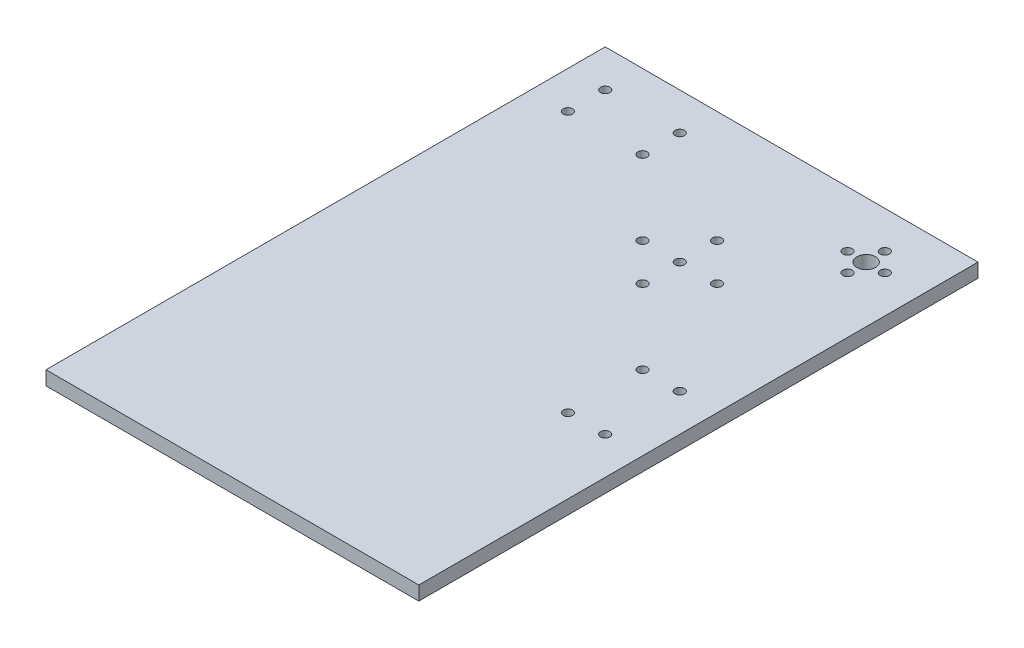
ISO-10303-21;
HEADER;
FILE_DESCRIPTION(('STEP AP214'),'2;1');
FILE_NAME('part.step','',(''),(''),'','','');
FILE_SCHEMA(('AUTOMOTIVE_DESIGN { 1 0 10303 214 1 1 1 1 }'));
ENDSEC;
DATA;
#1=APPLICATION_CONTEXT('core data for automotive mechanical design processes');
#2=APPLICATION_PROTOCOL_DEFINITION('international standard','automotive_design',2000,#1);
#3=PRODUCT_CONTEXT('',#1,'mechanical');
#4=PRODUCT('Part','Part','',(#3));
#5=PRODUCT_RELATED_PRODUCT_CATEGORY('part','',(#4));
#6=PRODUCT_DEFINITION_FORMATION('','',#4);
#7=PRODUCT_DEFINITION_CONTEXT('part definition',#1,'design');
#8=PRODUCT_DEFINITION('design','',#6,#7);
#9=PRODUCT_DEFINITION_SHAPE('','',#8);
#10=(LENGTH_UNIT() NAMED_UNIT(*) SI_UNIT(.MILLI.,.METRE.));
#11=(NAMED_UNIT(*) PLANE_ANGLE_UNIT() SI_UNIT($,.RADIAN.));
#12=(NAMED_UNIT(*) SI_UNIT($,.STERADIAN.) SOLID_ANGLE_UNIT());
#13=UNCERTAINTY_MEASURE_WITH_UNIT(LENGTH_MEASURE(1.E-05),#10,'distance_accuracy_value','');
#14=(GEOMETRIC_REPRESENTATION_CONTEXT(3) GLOBAL_UNCERTAINTY_ASSIGNED_CONTEXT((#13)) GLOBAL_UNIT_ASSIGNED_CONTEXT((#10,
#11,#12)) REPRESENTATION_CONTEXT('',''));
#15=CARTESIAN_POINT('',(0.,0.,0.));
#16=DIRECTION('',(0.,0.,1.));
#17=DIRECTION('',(1.,0.,0.));
#18=AXIS2_PLACEMENT_3D('',#15,#16,#17);
#19=CARTESIAN_POINT('',(-127.,9.525,127.));
#20=DIRECTION('',(1.,0.,0.));
#21=DIRECTION('',(0.,0.,-1.));
#22=AXIS2_PLACEMENT_3D('',#19,#20,#21);
#23=PLANE('',#22);
#24=DIRECTION('',(0.,0.,1.));
#25=VECTOR('',#24,1.);
#26=CARTESIAN_POINT('',(-127.,0.,127.));
#27=LINE('',#26,#25);
#28=CARTESIAN_POINT('',(-127.,0.,-127.));
#29=VERTEX_POINT('',#28);
#30=CARTESIAN_POINT('',(-127.,0.,254.));
#31=VERTEX_POINT('',#30);
#32=EDGE_CURVE('E82',#29,#31,#27,.T.);
#33=ORIENTED_EDGE('',*,*,#32,.T.);
#34=DIRECTION('',(0.,-1.,0.));
#35=VECTOR('',#34,1.);
#36=CARTESIAN_POINT('',(-127.,9.525,254.));
#37=LINE('',#36,#35);
#38=CARTESIAN_POINT('',(-127.,9.525,254.));
#39=VERTEX_POINT('',#38);
#40=EDGE_CURVE('E85',#39,#31,#37,.T.);
#41=ORIENTED_EDGE('',*,*,#40,.F.);
#42=DIRECTION('',(0.,0.,1.));
#43=VECTOR('',#42,1.);
#44=CARTESIAN_POINT('',(-127.,9.525,127.));
#45=LINE('',#44,#43);
#46=CARTESIAN_POINT('',(-127.,9.525,-127.));
#47=VERTEX_POINT('',#46);
#48=EDGE_CURVE('E69',#47,#39,#45,.T.);
#49=ORIENTED_EDGE('',*,*,#48,.F.);
#50=DIRECTION('',(0.,-1.,0.));
#51=VECTOR('',#50,1.);
#52=CARTESIAN_POINT('',(-127.,9.525,-127.));
#53=LINE('',#52,#51);
#54=EDGE_CURVE('E45',#47,#29,#53,.T.);
#55=ORIENTED_EDGE('',*,*,#54,.T.);
#56=EDGE_LOOP('',(#33,#41,#49,#55));
#57=FACE_BOUND('',#56,.T.);
#58=ADVANCED_FACE('F37',(#57),#23,.F.);
#59=CARTESIAN_POINT('',(127.,9.525,127.));
#60=DIRECTION('',(-1.,0.,0.));
#61=DIRECTION('',(0.,0.,1.));
#62=AXIS2_PLACEMENT_3D('',#59,#60,#61);
#63=PLANE('',#62);
#64=DIRECTION('',(0.,0.,-1.));
#65=VECTOR('',#64,1.);
#66=CARTESIAN_POINT('',(127.,0.,127.));
#67=LINE('',#66,#65);
#68=CARTESIAN_POINT('',(127.,0.,254.));
#69=VERTEX_POINT('',#68);
#70=CARTESIAN_POINT('',(127.,0.,-127.));
#71=VERTEX_POINT('',#70);
#72=EDGE_CURVE('E64',#69,#71,#67,.T.);
#73=ORIENTED_EDGE('',*,*,#72,.T.);
#74=DIRECTION('',(0.,-1.,0.));
#75=VECTOR('',#74,1.);
#76=CARTESIAN_POINT('',(127.,9.525,-127.));
#77=LINE('',#76,#75);
#78=CARTESIAN_POINT('',(127.,9.525,-127.));
#79=VERTEX_POINT('',#78);
#80=EDGE_CURVE('E11',#79,#71,#77,.T.);
#81=ORIENTED_EDGE('',*,*,#80,.F.);
#82=DIRECTION('',(0.,0.,-1.));
#83=VECTOR('',#82,1.);
#84=CARTESIAN_POINT('',(127.,9.525,127.));
#85=LINE('',#84,#83);
#86=CARTESIAN_POINT('',(127.,9.525,254.));
#87=VERTEX_POINT('',#86);
#88=EDGE_CURVE('E226',#87,#79,#85,.T.);
#89=ORIENTED_EDGE('',*,*,#88,.F.);
#90=DIRECTION('',(0.,1.,0.));
#91=VECTOR('',#90,1.);
#92=CARTESIAN_POINT('',(127.,0.,254.));
#93=LINE('',#92,#91);
#94=EDGE_CURVE('E97',#69,#87,#93,.T.);
#95=ORIENTED_EDGE('',*,*,#94,.F.);
#96=EDGE_LOOP('',(#73,#81,#89,#95));
#97=FACE_BOUND('',#96,.T.);
#98=ADVANCED_FACE('F234',(#97),#63,.F.);
#99=CARTESIAN_POINT('',(127.,9.525,-127.));
#100=DIRECTION('',(0.,0.,1.));
#101=DIRECTION('',(1.,0.,0.));
#102=AXIS2_PLACEMENT_3D('',#99,#100,#101);
#103=PLANE('',#102);
#104=DIRECTION('',(-1.,0.,0.));
#105=VECTOR('',#104,1.);
#106=CARTESIAN_POINT('',(127.,0.,-127.));
#107=LINE('',#106,#105);
#108=EDGE_CURVE('E227',#71,#29,#107,.T.);
#109=ORIENTED_EDGE('',*,*,#108,.T.);
#110=ORIENTED_EDGE('',*,*,#54,.F.);
#111=DIRECTION('',(-1.,0.,0.));
#112=VECTOR('',#111,1.);
#113=CARTESIAN_POINT('',(127.,9.525,-127.));
#114=LINE('',#113,#112);
#115=EDGE_CURVE('E53',#79,#47,#114,.T.);
#116=ORIENTED_EDGE('',*,*,#115,.F.);
#117=ORIENTED_EDGE('',*,*,#80,.T.);
#118=EDGE_LOOP('',(#109,#110,#116,#117));
#119=FACE_BOUND('',#118,.T.);
#120=ADVANCED_FACE('F233',(#119),#103,.F.);
#121=CARTESIAN_POINT('',(0.,9.525,0.));
#122=DIRECTION('',(0.,1.,0.));
#123=DIRECTION('',(0.,0.,1.));
#124=AXIS2_PLACEMENT_3D('',#121,#122,#123);
#125=PLANE('',#124);
#126=CARTESIAN_POINT('',(88.9,9.525,-88.9000000000001));
#127=DIRECTION('',(0.,1.,0.));
#128=DIRECTION('',(0.,0.,1.));
#129=AXIS2_PLACEMENT_3D('',#126,#127,#128);
#130=CIRCLE('',#129,6.34999999999999);
#131=CARTESIAN_POINT('',(88.9,9.525,-82.5500000000001));
#132=VERTEX_POINT('',#131);
#133=EDGE_CURVE('E106',#132,#132,#130,.T.);
#134=ORIENTED_EDGE('',*,*,#133,.F.);
#135=EDGE_LOOP('',(#134));
#136=FACE_BOUND('',#135,.T.);
#137=CARTESIAN_POINT('',(-50.8,9.525,-76.2000000000001));
#138=DIRECTION('',(0.,1.,0.));
#139=DIRECTION('',(0.,0.,1.));
#140=AXIS2_PLACEMENT_3D('',#137,#138,#139);
#141=CIRCLE('',#140,3.17499999999998);
#142=CARTESIAN_POINT('',(-50.8,9.525,-73.0250000000001));
#143=VERTEX_POINT('',#142);
#144=EDGE_CURVE('E112',#143,#143,#141,.T.);
#145=ORIENTED_EDGE('',*,*,#144,.F.);
#146=EDGE_LOOP('',(#145));
#147=FACE_BOUND('',#146,.T.);
#148=CARTESIAN_POINT('',(-50.8,9.525,-101.6));
#149=DIRECTION('',(0.,1.,0.));
#150=DIRECTION('',(0.,0.,1.));
#151=AXIS2_PLACEMENT_3D('',#148,#149,#150);
#152=CIRCLE('',#151,3.17499999999998);
#153=CARTESIAN_POINT('',(-50.8,9.525,-98.4250000000001));
#154=VERTEX_POINT('',#153);
#155=EDGE_CURVE('E120',#154,#154,#152,.T.);
#156=ORIENTED_EDGE('',*,*,#155,.F.);
#157=EDGE_LOOP('',(#156));
#158=FACE_BOUND('',#157,.T.);
#159=CARTESIAN_POINT('',(76.2,9.525,50.7999999999999));
#160=DIRECTION('',(0.,1.,0.));
#161=DIRECTION('',(0.,0.,1.));
#162=AXIS2_PLACEMENT_3D('',#159,#160,#161);
#163=CIRCLE('',#162,3.17499999999998);
#164=CARTESIAN_POINT('',(76.2,9.525,53.9749999999999));
#165=VERTEX_POINT('',#164);
#166=EDGE_CURVE('E128',#165,#165,#163,.T.);
#167=ORIENTED_EDGE('',*,*,#166,.F.);
#168=EDGE_LOOP('',(#167));
#169=FACE_BOUND('',#168,.T.);
#170=CARTESIAN_POINT('',(101.6,9.525,50.7999999999999));
#171=DIRECTION('',(0.,1.,0.));
#172=DIRECTION('',(0.,0.,1.));
#173=AXIS2_PLACEMENT_3D('',#170,#171,#172);
#174=CIRCLE('',#173,3.17499999999998);
#175=CARTESIAN_POINT('',(101.6,9.525,53.9749999999999));
#176=VERTEX_POINT('',#175);
#177=EDGE_CURVE('E134',#176,#176,#174,.T.);
#178=ORIENTED_EDGE('',*,*,#177,.F.);
#179=EDGE_LOOP('',(#178));
#180=FACE_BOUND('',#179,.T.);
#181=CARTESIAN_POINT('',(76.2,9.525,101.6));
#182=DIRECTION('',(0.,1.,0.));
#183=DIRECTION('',(0.,0.,1.));
#184=AXIS2_PLACEMENT_3D('',#181,#182,#183);
#185=CIRCLE('',#184,3.17499999999998);
#186=CARTESIAN_POINT('',(76.2,9.525,104.775));
#187=VERTEX_POINT('',#186);
#188=EDGE_CURVE('E140',#187,#187,#185,.T.);
#189=ORIENTED_EDGE('',*,*,#188,.F.);
#190=EDGE_LOOP('',(#189));
#191=FACE_BOUND('',#190,.T.);
#192=CARTESIAN_POINT('',(101.6,9.525,101.6));
#193=DIRECTION('',(0.,1.,0.));
#194=DIRECTION('',(0.,0.,1.));
#195=AXIS2_PLACEMENT_3D('',#192,#193,#194);
#196=CIRCLE('',#195,3.17499999999998);
#197=CARTESIAN_POINT('',(101.6,9.525,104.775));
#198=VERTEX_POINT('',#197);
#199=EDGE_CURVE('E146',#198,#198,#196,.T.);
#200=ORIENTED_EDGE('',*,*,#199,.F.);
#201=EDGE_LOOP('',(#200));
#202=FACE_BOUND('',#201,.T.);
#203=CARTESIAN_POINT('',(-101.6,9.525,-76.2000000000001));
#204=DIRECTION('',(0.,1.,0.));
#205=DIRECTION('',(0.,0.,1.));
#206=AXIS2_PLACEMENT_3D('',#203,#204,#205);
#207=CIRCLE('',#206,3.17499999999998);
#208=CARTESIAN_POINT('',(-101.6,9.525,-73.0250000000001));
#209=VERTEX_POINT('',#208);
#210=EDGE_CURVE('E152',#209,#209,#207,.T.);
#211=ORIENTED_EDGE('',*,*,#210,.F.);
#212=EDGE_LOOP('',(#211));
#213=FACE_BOUND('',#212,.T.);
#214=CARTESIAN_POINT('',(-101.6,9.525,-101.6));
#215=DIRECTION('',(0.,1.,0.));
#216=DIRECTION('',(0.,0.,1.));
#217=AXIS2_PLACEMENT_3D('',#214,#215,#216);
#218=CIRCLE('',#217,3.17499999999998);
#219=CARTESIAN_POINT('',(-101.6,9.525,-98.4250000000001));
#220=VERTEX_POINT('',#219);
#221=EDGE_CURVE('E160',#220,#220,#218,.T.);
#222=ORIENTED_EDGE('',*,*,#221,.F.);
#223=EDGE_LOOP('',(#222));
#224=FACE_BOUND('',#223,.T.);
#225=CARTESIAN_POINT('',(25.4,9.525,-50.8000000000001));
#226=DIRECTION('',(0.,1.,0.));
#227=DIRECTION('',(0.,0.,1.));
#228=AXIS2_PLACEMENT_3D('',#225,#226,#227);
#229=CIRCLE('',#228,3.17499999999998);
#230=CARTESIAN_POINT('',(25.4,9.525,-47.6250000000001));
#231=VERTEX_POINT('',#230);
#232=EDGE_CURVE('E166',#231,#231,#229,.T.);
#233=ORIENTED_EDGE('',*,*,#232,.F.);
#234=EDGE_LOOP('',(#233));
#235=FACE_BOUND('',#234,.T.);
#236=CARTESIAN_POINT('',(50.8,9.525,-25.4000000000001));
#237=DIRECTION('',(0.,1.,0.));
#238=DIRECTION('',(0.,0.,1.));
#239=AXIS2_PLACEMENT_3D('',#236,#237,#238);
#240=CIRCLE('',#239,3.17499999999998);
#241=CARTESIAN_POINT('',(50.8,9.525,-22.2250000000001));
#242=VERTEX_POINT('',#241);
#243=EDGE_CURVE('E172',#242,#242,#240,.T.);
#244=ORIENTED_EDGE('',*,*,#243,.F.);
#245=EDGE_LOOP('',(#244));
#246=FACE_BOUND('',#245,.T.);
#247=CARTESIAN_POINT('',(25.4,9.525,0.));
#248=DIRECTION('',(0.,1.,0.));
#249=DIRECTION('',(0.,0.,1.));
#250=AXIS2_PLACEMENT_3D('',#247,#248,#249);
#251=CIRCLE('',#250,3.17499999999998);
#252=CARTESIAN_POINT('',(25.4,9.525,3.17499999999991));
#253=VERTEX_POINT('',#252);
#254=EDGE_CURVE('E178',#253,#253,#251,.T.);
#255=ORIENTED_EDGE('',*,*,#254,.F.);
#256=EDGE_LOOP('',(#255));
#257=FACE_BOUND('',#256,.T.);
#258=CARTESIAN_POINT('',(0.,9.525,-25.4000000000001));
#259=DIRECTION('',(0.,1.,0.));
#260=DIRECTION('',(0.,0.,1.));
#261=AXIS2_PLACEMENT_3D('',#258,#259,#260);
#262=CIRCLE('',#261,3.17499999999998);
#263=CARTESIAN_POINT('',(0.,9.525,-22.2250000000001));
#264=VERTEX_POINT('',#263);
#265=EDGE_CURVE('E185',#264,#264,#262,.T.);
#266=ORIENTED_EDGE('',*,*,#265,.F.);
#267=EDGE_LOOP('',(#266));
#268=FACE_BOUND('',#267,.T.);
#269=CARTESIAN_POINT('',(25.4,9.525,-25.4000000000001));
#270=DIRECTION('',(0.,1.,0.));
#271=DIRECTION('',(0.,0.,1.));
#272=AXIS2_PLACEMENT_3D('',#269,#270,#271);
#273=CIRCLE('',#272,3.17499999999998);
#274=CARTESIAN_POINT('',(25.4,9.525,-22.2250000000001));
#275=VERTEX_POINT('',#274);
#276=EDGE_CURVE('E193',#275,#275,#273,.T.);
#277=ORIENTED_EDGE('',*,*,#276,.F.);
#278=EDGE_LOOP('',(#277));
#279=FACE_BOUND('',#278,.T.);
#280=CARTESIAN_POINT('',(88.9,9.525,-76.2000000000001));
#281=DIRECTION('',(0.,1.,0.));
#282=DIRECTION('',(0.,0.,1.));
#283=AXIS2_PLACEMENT_3D('',#280,#281,#282);
#284=CIRCLE('',#283,3.17499999999998);
#285=CARTESIAN_POINT('',(88.9,9.525,-73.0250000000001));
#286=VERTEX_POINT('',#285);
#287=EDGE_CURVE('E201',#286,#286,#284,.T.);
#288=ORIENTED_EDGE('',*,*,#287,.F.);
#289=EDGE_LOOP('',(#288));
#290=FACE_BOUND('',#289,.T.);
#291=CARTESIAN_POINT('',(76.2,9.525,-88.9000000000001));
#292=DIRECTION('',(0.,1.,0.));
#293=DIRECTION('',(0.,0.,1.));
#294=AXIS2_PLACEMENT_3D('',#291,#292,#293);
#295=CIRCLE('',#294,3.17499999999998);
#296=CARTESIAN_POINT('',(76.2,9.525,-85.7250000000001));
#297=VERTEX_POINT('',#296);
#298=EDGE_CURVE('E207',#297,#297,#295,.T.);
#299=ORIENTED_EDGE('',*,*,#298,.F.);
#300=EDGE_LOOP('',(#299));
#301=FACE_BOUND('',#300,.T.);
#302=CARTESIAN_POINT('',(88.9,9.525,-101.6));
#303=DIRECTION('',(0.,1.,0.));
#304=DIRECTION('',(0.,0.,1.));
#305=AXIS2_PLACEMENT_3D('',#302,#303,#304);
#306=CIRCLE('',#305,3.17499999999998);
#307=CARTESIAN_POINT('',(88.9,9.525,-98.4250000000001));
#308=VERTEX_POINT('',#307);
#309=EDGE_CURVE('E213',#308,#308,#306,.T.);
#310=ORIENTED_EDGE('',*,*,#309,.F.);
#311=EDGE_LOOP('',(#310));
#312=FACE_BOUND('',#311,.T.);
#313=CARTESIAN_POINT('',(101.6,9.525,-88.9000000000001));
#314=DIRECTION('',(0.,1.,0.));
#315=DIRECTION('',(0.,0.,1.));
#316=AXIS2_PLACEMENT_3D('',#313,#314,#315);
#317=CIRCLE('',#316,3.17499999999998);
#318=CARTESIAN_POINT('',(101.6,9.525,-85.7250000000001));
#319=VERTEX_POINT('',#318);
#320=EDGE_CURVE('E219',#319,#319,#317,.T.);
#321=ORIENTED_EDGE('',*,*,#320,.F.);
#322=EDGE_LOOP('',(#321));
#323=FACE_BOUND('',#322,.T.);
#324=ORIENTED_EDGE('',*,*,#48,.T.);
#325=DIRECTION('',(-1.,0.,0.));
#326=VECTOR('',#325,1.);
#327=CARTESIAN_POINT('',(127.,9.525,254.));
#328=LINE('',#327,#326);
#329=EDGE_CURVE('E100',#87,#39,#328,.T.);
#330=ORIENTED_EDGE('',*,*,#329,.F.);
#331=ORIENTED_EDGE('',*,*,#88,.T.);
#332=ORIENTED_EDGE('',*,*,#115,.T.);
#333=EDGE_LOOP('',(#324,#330,#331,#332));
#334=FACE_BOUND('',#333,.T.);
#335=ADVANCED_FACE('F235',(#136,#147,#158,#169,#180,#191,#202,#213,#224,#235,#246,#257,#268,
#279,#290,#301,#312,#323,#334),#125,.T.);
#336=CARTESIAN_POINT('',(0.,0.,0.));
#337=DIRECTION('',(0.,1.,0.));
#338=DIRECTION('',(0.,0.,1.));
#339=AXIS2_PLACEMENT_3D('',#336,#337,#338);
#340=PLANE('',#339);
#341=CARTESIAN_POINT('',(88.9,0.,-88.9000000000001));
#342=DIRECTION('',(0.,1.,0.));
#343=DIRECTION('',(0.,0.,1.));
#344=AXIS2_PLACEMENT_3D('',#341,#342,#343);
#345=CIRCLE('',#344,6.34999999999999);
#346=CARTESIAN_POINT('',(88.9,0.,-82.5500000000001));
#347=VERTEX_POINT('',#346);
#348=EDGE_CURVE('E109',#347,#347,#345,.T.);
#349=ORIENTED_EDGE('',*,*,#348,.T.);
#350=EDGE_LOOP('',(#349));
#351=FACE_BOUND('',#350,.T.);
#352=CARTESIAN_POINT('',(-50.8,0.,-76.2000000000001));
#353=DIRECTION('',(0.,1.,0.));
#354=DIRECTION('',(0.,0.,1.));
#355=AXIS2_PLACEMENT_3D('',#352,#353,#354);
#356=CIRCLE('',#355,3.17499999999998);
#357=CARTESIAN_POINT('',(-50.8,0.,-73.0250000000001));
#358=VERTEX_POINT('',#357);
#359=EDGE_CURVE('E116',#358,#358,#356,.T.);
#360=ORIENTED_EDGE('',*,*,#359,.T.);
#361=EDGE_LOOP('',(#360));
#362=FACE_BOUND('',#361,.T.);
#363=CARTESIAN_POINT('',(-50.8,0.,-101.6));
#364=DIRECTION('',(0.,1.,0.));
#365=DIRECTION('',(0.,0.,1.));
#366=AXIS2_PLACEMENT_3D('',#363,#364,#365);
#367=CIRCLE('',#366,3.17499999999998);
#368=CARTESIAN_POINT('',(-50.8,0.,-98.4250000000001));
#369=VERTEX_POINT('',#368);
#370=EDGE_CURVE('E124',#369,#369,#367,.T.);
#371=ORIENTED_EDGE('',*,*,#370,.T.);
#372=EDGE_LOOP('',(#371));
#373=FACE_BOUND('',#372,.T.);
#374=CARTESIAN_POINT('',(76.2,0.,50.7999999999999));
#375=DIRECTION('',(0.,1.,0.));
#376=DIRECTION('',(0.,0.,1.));
#377=AXIS2_PLACEMENT_3D('',#374,#375,#376);
#378=CIRCLE('',#377,3.17499999999998);
#379=CARTESIAN_POINT('',(76.2,0.,53.9749999999999));
#380=VERTEX_POINT('',#379);
#381=EDGE_CURVE('E131',#380,#380,#378,.T.);
#382=ORIENTED_EDGE('',*,*,#381,.T.);
#383=EDGE_LOOP('',(#382));
#384=FACE_BOUND('',#383,.T.);
#385=CARTESIAN_POINT('',(101.6,0.,50.7999999999999));
#386=DIRECTION('',(0.,1.,0.));
#387=DIRECTION('',(0.,0.,1.));
#388=AXIS2_PLACEMENT_3D('',#385,#386,#387);
#389=CIRCLE('',#388,3.17499999999998);
#390=CARTESIAN_POINT('',(101.6,0.,53.9749999999999));
#391=VERTEX_POINT('',#390);
#392=EDGE_CURVE('E137',#391,#391,#389,.T.);
#393=ORIENTED_EDGE('',*,*,#392,.T.);
#394=EDGE_LOOP('',(#393));
#395=FACE_BOUND('',#394,.T.);
#396=CARTESIAN_POINT('',(76.2,0.,101.6));
#397=DIRECTION('',(0.,1.,0.));
#398=DIRECTION('',(0.,0.,1.));
#399=AXIS2_PLACEMENT_3D('',#396,#397,#398);
#400=CIRCLE('',#399,3.17499999999998);
#401=CARTESIAN_POINT('',(76.2,0.,104.775));
#402=VERTEX_POINT('',#401);
#403=EDGE_CURVE('E143',#402,#402,#400,.T.);
#404=ORIENTED_EDGE('',*,*,#403,.T.);
#405=EDGE_LOOP('',(#404));
#406=FACE_BOUND('',#405,.T.);
#407=CARTESIAN_POINT('',(101.6,0.,101.6));
#408=DIRECTION('',(0.,1.,0.));
#409=DIRECTION('',(0.,0.,1.));
#410=AXIS2_PLACEMENT_3D('',#407,#408,#409);
#411=CIRCLE('',#410,3.17499999999998);
#412=CARTESIAN_POINT('',(101.6,0.,104.775));
#413=VERTEX_POINT('',#412);
#414=EDGE_CURVE('E149',#413,#413,#411,.T.);
#415=ORIENTED_EDGE('',*,*,#414,.T.);
#416=EDGE_LOOP('',(#415));
#417=FACE_BOUND('',#416,.T.);
#418=CARTESIAN_POINT('',(-101.6,0.,-76.2000000000001));
#419=DIRECTION('',(0.,1.,0.));
#420=DIRECTION('',(0.,0.,1.));
#421=AXIS2_PLACEMENT_3D('',#418,#419,#420);
#422=CIRCLE('',#421,3.17499999999998);
#423=CARTESIAN_POINT('',(-101.6,0.,-73.0250000000001));
#424=VERTEX_POINT('',#423);
#425=EDGE_CURVE('E156',#424,#424,#422,.T.);
#426=ORIENTED_EDGE('',*,*,#425,.T.);
#427=EDGE_LOOP('',(#426));
#428=FACE_BOUND('',#427,.T.);
#429=CARTESIAN_POINT('',(-101.6,0.,-101.6));
#430=DIRECTION('',(0.,1.,0.));
#431=DIRECTION('',(0.,0.,1.));
#432=AXIS2_PLACEMENT_3D('',#429,#430,#431);
#433=CIRCLE('',#432,3.17499999999998);
#434=CARTESIAN_POINT('',(-101.6,0.,-98.4250000000001));
#435=VERTEX_POINT('',#434);
#436=EDGE_CURVE('E163',#435,#435,#433,.T.);
#437=ORIENTED_EDGE('',*,*,#436,.T.);
#438=EDGE_LOOP('',(#437));
#439=FACE_BOUND('',#438,.T.);
#440=CARTESIAN_POINT('',(25.4,0.,-50.8000000000001));
#441=DIRECTION('',(0.,1.,0.));
#442=DIRECTION('',(0.,0.,1.));
#443=AXIS2_PLACEMENT_3D('',#440,#441,#442);
#444=CIRCLE('',#443,3.17499999999998);
#445=CARTESIAN_POINT('',(25.4,0.,-47.6250000000001));
#446=VERTEX_POINT('',#445);
#447=EDGE_CURVE('E169',#446,#446,#444,.T.);
#448=ORIENTED_EDGE('',*,*,#447,.T.);
#449=EDGE_LOOP('',(#448));
#450=FACE_BOUND('',#449,.T.);
#451=CARTESIAN_POINT('',(50.8,0.,-25.4000000000001));
#452=DIRECTION('',(0.,1.,0.));
#453=DIRECTION('',(0.,0.,1.));
#454=AXIS2_PLACEMENT_3D('',#451,#452,#453);
#455=CIRCLE('',#454,3.17499999999998);
#456=CARTESIAN_POINT('',(50.8,0.,-22.2250000000001));
#457=VERTEX_POINT('',#456);
#458=EDGE_CURVE('E175',#457,#457,#455,.T.);
#459=ORIENTED_EDGE('',*,*,#458,.T.);
#460=EDGE_LOOP('',(#459));
#461=FACE_BOUND('',#460,.T.);
#462=CARTESIAN_POINT('',(25.4,0.,0.));
#463=DIRECTION('',(0.,1.,0.));
#464=DIRECTION('',(0.,0.,1.));
#465=AXIS2_PLACEMENT_3D('',#462,#463,#464);
#466=CIRCLE('',#465,3.17499999999998);
#467=CARTESIAN_POINT('',(25.4,0.,3.17499999999991));
#468=VERTEX_POINT('',#467);
#469=EDGE_CURVE('E182',#468,#468,#466,.T.);
#470=ORIENTED_EDGE('',*,*,#469,.T.);
#471=EDGE_LOOP('',(#470));
#472=FACE_BOUND('',#471,.T.);
#473=CARTESIAN_POINT('',(0.,0.,-25.4000000000001));
#474=DIRECTION('',(0.,1.,0.));
#475=DIRECTION('',(0.,0.,1.));
#476=AXIS2_PLACEMENT_3D('',#473,#474,#475);
#477=CIRCLE('',#476,3.17499999999998);
#478=CARTESIAN_POINT('',(0.,0.,-22.2250000000001));
#479=VERTEX_POINT('',#478);
#480=EDGE_CURVE('E189',#479,#479,#477,.T.);
#481=ORIENTED_EDGE('',*,*,#480,.T.);
#482=EDGE_LOOP('',(#481));
#483=FACE_BOUND('',#482,.T.);
#484=CARTESIAN_POINT('',(25.4,0.,-25.4000000000001));
#485=DIRECTION('',(0.,1.,0.));
#486=DIRECTION('',(0.,0.,1.));
#487=AXIS2_PLACEMENT_3D('',#484,#485,#486);
#488=CIRCLE('',#487,3.17499999999998);
#489=CARTESIAN_POINT('',(25.4,0.,-22.2250000000001));
#490=VERTEX_POINT('',#489);
#491=EDGE_CURVE('E197',#490,#490,#488,.T.);
#492=ORIENTED_EDGE('',*,*,#491,.T.);
#493=EDGE_LOOP('',(#492));
#494=FACE_BOUND('',#493,.T.);
#495=CARTESIAN_POINT('',(88.9,0.,-76.2000000000001));
#496=DIRECTION('',(0.,1.,0.));
#497=DIRECTION('',(0.,0.,1.));
#498=AXIS2_PLACEMENT_3D('',#495,#496,#497);
#499=CIRCLE('',#498,3.17499999999998);
#500=CARTESIAN_POINT('',(88.9,0.,-73.0250000000001));
#501=VERTEX_POINT('',#500);
#502=EDGE_CURVE('E204',#501,#501,#499,.T.);
#503=ORIENTED_EDGE('',*,*,#502,.T.);
#504=EDGE_LOOP('',(#503));
#505=FACE_BOUND('',#504,.T.);
#506=CARTESIAN_POINT('',(76.2,0.,-88.9000000000001));
#507=DIRECTION('',(0.,1.,0.));
#508=DIRECTION('',(0.,0.,1.));
#509=AXIS2_PLACEMENT_3D('',#506,#507,#508);
#510=CIRCLE('',#509,3.17499999999998);
#511=CARTESIAN_POINT('',(76.2,0.,-85.7250000000001));
#512=VERTEX_POINT('',#511);
#513=EDGE_CURVE('E210',#512,#512,#510,.T.);
#514=ORIENTED_EDGE('',*,*,#513,.T.);
#515=EDGE_LOOP('',(#514));
#516=FACE_BOUND('',#515,.T.);
#517=CARTESIAN_POINT('',(88.9,0.,-101.6));
#518=DIRECTION('',(0.,1.,0.));
#519=DIRECTION('',(0.,0.,1.));
#520=AXIS2_PLACEMENT_3D('',#517,#518,#519);
#521=CIRCLE('',#520,3.17499999999998);
#522=CARTESIAN_POINT('',(88.9,0.,-98.4250000000001));
#523=VERTEX_POINT('',#522);
#524=EDGE_CURVE('E216',#523,#523,#521,.T.);
#525=ORIENTED_EDGE('',*,*,#524,.T.);
#526=EDGE_LOOP('',(#525));
#527=FACE_BOUND('',#526,.T.);
#528=CARTESIAN_POINT('',(101.6,0.,-88.9000000000001));
#529=DIRECTION('',(0.,1.,0.));
#530=DIRECTION('',(0.,0.,1.));
#531=AXIS2_PLACEMENT_3D('',#528,#529,#530);
#532=CIRCLE('',#531,3.17499999999998);
#533=CARTESIAN_POINT('',(101.6,0.,-85.7250000000001));
#534=VERTEX_POINT('',#533);
#535=EDGE_CURVE('E89',#534,#534,#532,.T.);
#536=ORIENTED_EDGE('',*,*,#535,.T.);
#537=EDGE_LOOP('',(#536));
#538=FACE_BOUND('',#537,.T.);
#539=ORIENTED_EDGE('',*,*,#32,.F.);
#540=ORIENTED_EDGE('',*,*,#108,.F.);
#541=ORIENTED_EDGE('',*,*,#72,.F.);
#542=DIRECTION('',(1.,0.,0.));
#543=VECTOR('',#542,1.);
#544=CARTESIAN_POINT('',(-127.,0.,254.));
#545=LINE('',#544,#543);
#546=EDGE_CURVE('E92',#31,#69,#545,.T.);
#547=ORIENTED_EDGE('',*,*,#546,.F.);
#548=EDGE_LOOP('',(#539,#540,#541,#547));
#549=FACE_BOUND('',#548,.T.);
#550=ADVANCED_FACE('F93',(#351,#362,#373,#384,#395,#406,#417,#428,#439,#450,#461,#472,#483,#494,
#505,#516,#527,#538,#549),#340,.F.);
#551=CARTESIAN_POINT('',(101.6,9.525,-88.9000000000001));
#552=DIRECTION('',(0.,1.,0.));
#553=DIRECTION('',(0.,0.,1.));
#554=AXIS2_PLACEMENT_3D('',#551,#552,#553);
#555=CYLINDRICAL_SURFACE('',#554,3.17499999999998);
#556=ORIENTED_EDGE('',*,*,#535,.F.);
#557=EDGE_LOOP('',(#556));
#558=FACE_BOUND('',#557,.T.);
#559=ORIENTED_EDGE('',*,*,#320,.T.);
#560=EDGE_LOOP('',(#559));
#561=FACE_BOUND('',#560,.T.);
#562=ADVANCED_FACE('F243',(#558,#561),#555,.F.);
#563=CARTESIAN_POINT('',(88.9,9.525,-101.6));
#564=DIRECTION('',(0.,1.,0.));
#565=DIRECTION('',(0.,0.,1.));
#566=AXIS2_PLACEMENT_3D('',#563,#564,#565);
#567=CYLINDRICAL_SURFACE('',#566,3.17499999999998);
#568=ORIENTED_EDGE('',*,*,#524,.F.);
#569=EDGE_LOOP('',(#568));
#570=FACE_BOUND('',#569,.T.);
#571=ORIENTED_EDGE('',*,*,#309,.T.);
#572=EDGE_LOOP('',(#571));
#573=FACE_BOUND('',#572,.T.);
#574=ADVANCED_FACE('F272',(#570,#573),#567,.F.);
#575=CARTESIAN_POINT('',(76.2,9.525,-88.9000000000001));
#576=DIRECTION('',(0.,1.,0.));
#577=DIRECTION('',(0.,0.,1.));
#578=AXIS2_PLACEMENT_3D('',#575,#576,#577);
#579=CYLINDRICAL_SURFACE('',#578,3.17499999999998);
#580=ORIENTED_EDGE('',*,*,#513,.F.);
#581=EDGE_LOOP('',(#580));
#582=FACE_BOUND('',#581,.T.);
#583=ORIENTED_EDGE('',*,*,#298,.T.);
#584=EDGE_LOOP('',(#583));
#585=FACE_BOUND('',#584,.T.);
#586=ADVANCED_FACE('F282',(#582,#585),#579,.F.);
#587=CARTESIAN_POINT('',(88.9,9.525,-76.2000000000001));
#588=DIRECTION('',(0.,1.,0.));
#589=DIRECTION('',(0.,0.,1.));
#590=AXIS2_PLACEMENT_3D('',#587,#588,#589);
#591=CYLINDRICAL_SURFACE('',#590,3.17499999999998);
#592=ORIENTED_EDGE('',*,*,#502,.F.);
#593=EDGE_LOOP('',(#592));
#594=FACE_BOUND('',#593,.T.);
#595=ORIENTED_EDGE('',*,*,#287,.T.);
#596=EDGE_LOOP('',(#595));
#597=FACE_BOUND('',#596,.T.);
#598=ADVANCED_FACE('F292',(#594,#597),#591,.F.);
#599=CARTESIAN_POINT('',(25.4,9.525,-25.4000000000001));
#600=DIRECTION('',(0.,1.,0.));
#601=DIRECTION('',(0.,0.,1.));
#602=AXIS2_PLACEMENT_3D('',#599,#600,#601);
#603=CYLINDRICAL_SURFACE('',#602,3.17499999999998);
#604=ORIENTED_EDGE('',*,*,#491,.F.);
#605=EDGE_LOOP('',(#604));
#606=FACE_BOUND('',#605,.T.);
#607=ORIENTED_EDGE('',*,*,#276,.T.);
#608=EDGE_LOOP('',(#607));
#609=FACE_BOUND('',#608,.T.);
#610=ADVANCED_FACE('F302',(#606,#609),#603,.F.);
#611=CARTESIAN_POINT('',(0.,9.525,-25.4000000000001));
#612=DIRECTION('',(0.,1.,0.));
#613=DIRECTION('',(0.,0.,1.));
#614=AXIS2_PLACEMENT_3D('',#611,#612,#613);
#615=CYLINDRICAL_SURFACE('',#614,3.17499999999998);
#616=ORIENTED_EDGE('',*,*,#480,.F.);
#617=EDGE_LOOP('',(#616));
#618=FACE_BOUND('',#617,.T.);
#619=ORIENTED_EDGE('',*,*,#265,.T.);
#620=EDGE_LOOP('',(#619));
#621=FACE_BOUND('',#620,.T.);
#622=ADVANCED_FACE('F312',(#618,#621),#615,.F.);
#623=CARTESIAN_POINT('',(25.4,9.525,0.));
#624=DIRECTION('',(0.,1.,0.));
#625=DIRECTION('',(0.,0.,1.));
#626=AXIS2_PLACEMENT_3D('',#623,#624,#625);
#627=CYLINDRICAL_SURFACE('',#626,3.17499999999998);
#628=ORIENTED_EDGE('',*,*,#469,.F.);
#629=EDGE_LOOP('',(#628));
#630=FACE_BOUND('',#629,.T.);
#631=ORIENTED_EDGE('',*,*,#254,.T.);
#632=EDGE_LOOP('',(#631));
#633=FACE_BOUND('',#632,.T.);
#634=ADVANCED_FACE('F322',(#630,#633),#627,.F.);
#635=CARTESIAN_POINT('',(50.8,9.525,-25.4000000000001));
#636=DIRECTION('',(0.,1.,0.));
#637=DIRECTION('',(0.,0.,1.));
#638=AXIS2_PLACEMENT_3D('',#635,#636,#637);
#639=CYLINDRICAL_SURFACE('',#638,3.17499999999998);
#640=ORIENTED_EDGE('',*,*,#458,.F.);
#641=EDGE_LOOP('',(#640));
#642=FACE_BOUND('',#641,.T.);
#643=ORIENTED_EDGE('',*,*,#243,.T.);
#644=EDGE_LOOP('',(#643));
#645=FACE_BOUND('',#644,.T.);
#646=ADVANCED_FACE('F332',(#642,#645),#639,.F.);
#647=CARTESIAN_POINT('',(25.4,9.525,-50.8000000000001));
#648=DIRECTION('',(0.,1.,0.));
#649=DIRECTION('',(0.,0.,1.));
#650=AXIS2_PLACEMENT_3D('',#647,#648,#649);
#651=CYLINDRICAL_SURFACE('',#650,3.17499999999998);
#652=ORIENTED_EDGE('',*,*,#447,.F.);
#653=EDGE_LOOP('',(#652));
#654=FACE_BOUND('',#653,.T.);
#655=ORIENTED_EDGE('',*,*,#232,.T.);
#656=EDGE_LOOP('',(#655));
#657=FACE_BOUND('',#656,.T.);
#658=ADVANCED_FACE('F342',(#654,#657),#651,.F.);
#659=CARTESIAN_POINT('',(-101.6,9.525,-101.6));
#660=DIRECTION('',(0.,1.,0.));
#661=DIRECTION('',(0.,0.,1.));
#662=AXIS2_PLACEMENT_3D('',#659,#660,#661);
#663=CYLINDRICAL_SURFACE('',#662,3.17499999999998);
#664=ORIENTED_EDGE('',*,*,#436,.F.);
#665=EDGE_LOOP('',(#664));
#666=FACE_BOUND('',#665,.T.);
#667=ORIENTED_EDGE('',*,*,#221,.T.);
#668=EDGE_LOOP('',(#667));
#669=FACE_BOUND('',#668,.T.);
#670=ADVANCED_FACE('F352',(#666,#669),#663,.F.);
#671=CARTESIAN_POINT('',(-101.6,9.525,-76.2000000000001));
#672=DIRECTION('',(0.,1.,0.));
#673=DIRECTION('',(0.,0.,1.));
#674=AXIS2_PLACEMENT_3D('',#671,#672,#673);
#675=CYLINDRICAL_SURFACE('',#674,3.17499999999998);
#676=ORIENTED_EDGE('',*,*,#425,.F.);
#677=EDGE_LOOP('',(#676));
#678=FACE_BOUND('',#677,.T.);
#679=ORIENTED_EDGE('',*,*,#210,.T.);
#680=EDGE_LOOP('',(#679));
#681=FACE_BOUND('',#680,.T.);
#682=ADVANCED_FACE('F362',(#678,#681),#675,.F.);
#683=CARTESIAN_POINT('',(101.6,9.525,101.6));
#684=DIRECTION('',(0.,1.,0.));
#685=DIRECTION('',(0.,0.,1.));
#686=AXIS2_PLACEMENT_3D('',#683,#684,#685);
#687=CYLINDRICAL_SURFACE('',#686,3.17499999999998);
#688=ORIENTED_EDGE('',*,*,#414,.F.);
#689=EDGE_LOOP('',(#688));
#690=FACE_BOUND('',#689,.T.);
#691=ORIENTED_EDGE('',*,*,#199,.T.);
#692=EDGE_LOOP('',(#691));
#693=FACE_BOUND('',#692,.T.);
#694=ADVANCED_FACE('F372',(#690,#693),#687,.F.);
#695=CARTESIAN_POINT('',(76.2,9.525,101.6));
#696=DIRECTION('',(0.,1.,0.));
#697=DIRECTION('',(0.,0.,1.));
#698=AXIS2_PLACEMENT_3D('',#695,#696,#697);
#699=CYLINDRICAL_SURFACE('',#698,3.17499999999998);
#700=ORIENTED_EDGE('',*,*,#403,.F.);
#701=EDGE_LOOP('',(#700));
#702=FACE_BOUND('',#701,.T.);
#703=ORIENTED_EDGE('',*,*,#188,.T.);
#704=EDGE_LOOP('',(#703));
#705=FACE_BOUND('',#704,.T.);
#706=ADVANCED_FACE('F382',(#702,#705),#699,.F.);
#707=CARTESIAN_POINT('',(101.6,9.525,50.7999999999999));
#708=DIRECTION('',(0.,1.,0.));
#709=DIRECTION('',(0.,0.,1.));
#710=AXIS2_PLACEMENT_3D('',#707,#708,#709);
#711=CYLINDRICAL_SURFACE('',#710,3.17499999999998);
#712=ORIENTED_EDGE('',*,*,#392,.F.);
#713=EDGE_LOOP('',(#712));
#714=FACE_BOUND('',#713,.T.);
#715=ORIENTED_EDGE('',*,*,#177,.T.);
#716=EDGE_LOOP('',(#715));
#717=FACE_BOUND('',#716,.T.);
#718=ADVANCED_FACE('F392',(#714,#717),#711,.F.);
#719=CARTESIAN_POINT('',(76.2,9.525,50.7999999999999));
#720=DIRECTION('',(0.,1.,0.));
#721=DIRECTION('',(0.,0.,1.));
#722=AXIS2_PLACEMENT_3D('',#719,#720,#721);
#723=CYLINDRICAL_SURFACE('',#722,3.17499999999998);
#724=ORIENTED_EDGE('',*,*,#381,.F.);
#725=EDGE_LOOP('',(#724));
#726=FACE_BOUND('',#725,.T.);
#727=ORIENTED_EDGE('',*,*,#166,.T.);
#728=EDGE_LOOP('',(#727));
#729=FACE_BOUND('',#728,.T.);
#730=ADVANCED_FACE('F402',(#726,#729),#723,.F.);
#731=CARTESIAN_POINT('',(-50.8,9.525,-101.6));
#732=DIRECTION('',(0.,1.,0.));
#733=DIRECTION('',(0.,0.,1.));
#734=AXIS2_PLACEMENT_3D('',#731,#732,#733);
#735=CYLINDRICAL_SURFACE('',#734,3.17499999999998);
#736=ORIENTED_EDGE('',*,*,#370,.F.);
#737=EDGE_LOOP('',(#736));
#738=FACE_BOUND('',#737,.T.);
#739=ORIENTED_EDGE('',*,*,#155,.T.);
#740=EDGE_LOOP('',(#739));
#741=FACE_BOUND('',#740,.T.);
#742=ADVANCED_FACE('F412',(#738,#741),#735,.F.);
#743=CARTESIAN_POINT('',(-50.8,9.525,-76.2000000000001));
#744=DIRECTION('',(0.,1.,0.));
#745=DIRECTION('',(0.,0.,1.));
#746=AXIS2_PLACEMENT_3D('',#743,#744,#745);
#747=CYLINDRICAL_SURFACE('',#746,3.17499999999998);
#748=ORIENTED_EDGE('',*,*,#359,.F.);
#749=EDGE_LOOP('',(#748));
#750=FACE_BOUND('',#749,.T.);
#751=ORIENTED_EDGE('',*,*,#144,.T.);
#752=EDGE_LOOP('',(#751));
#753=FACE_BOUND('',#752,.T.);
#754=ADVANCED_FACE('F422',(#750,#753),#747,.F.);
#755=CARTESIAN_POINT('',(88.9,9.525,-88.9000000000001));
#756=DIRECTION('',(0.,1.,0.));
#757=DIRECTION('',(0.,0.,1.));
#758=AXIS2_PLACEMENT_3D('',#755,#756,#757);
#759=CYLINDRICAL_SURFACE('',#758,6.34999999999999);
#760=ORIENTED_EDGE('',*,*,#348,.F.);
#761=EDGE_LOOP('',(#760));
#762=FACE_BOUND('',#761,.T.);
#763=ORIENTED_EDGE('',*,*,#133,.T.);
#764=EDGE_LOOP('',(#763));
#765=FACE_BOUND('',#764,.T.);
#766=ADVANCED_FACE('F432',(#762,#765),#759,.F.);
#767=CARTESIAN_POINT('',(0.,0.,254.));
#768=DIRECTION('',(0.,0.,1.));
#769=DIRECTION('',(1.,0.,0.));
#770=AXIS2_PLACEMENT_3D('',#767,#768,#769);
#771=PLANE('',#770);
#772=ORIENTED_EDGE('',*,*,#40,.T.);
#773=ORIENTED_EDGE('',*,*,#546,.T.);
#774=ORIENTED_EDGE('',*,*,#94,.T.);
#775=ORIENTED_EDGE('',*,*,#329,.T.);
#776=EDGE_LOOP('',(#772,#773,#774,#775));
#777=FACE_BOUND('',#776,.T.);
#778=ADVANCED_FACE('F99',(#777),#771,.T.);
#779=CLOSED_SHELL('',(#58,#98,#120,#335,#550,#562,#574,#586,#598,#610,#622,#634,#646,#658,#670,
#682,#694,#706,#718,#730,#742,#754,#766,#778));
#780=MANIFOLD_SOLID_BREP('B2',#779);
#781=ADVANCED_BREP_SHAPE_REPRESENTATION('',(#18,#780),#14);
#782=SHAPE_DEFINITION_REPRESENTATION(#9,#781);
ENDSEC;
END-ISO-10303-21;
